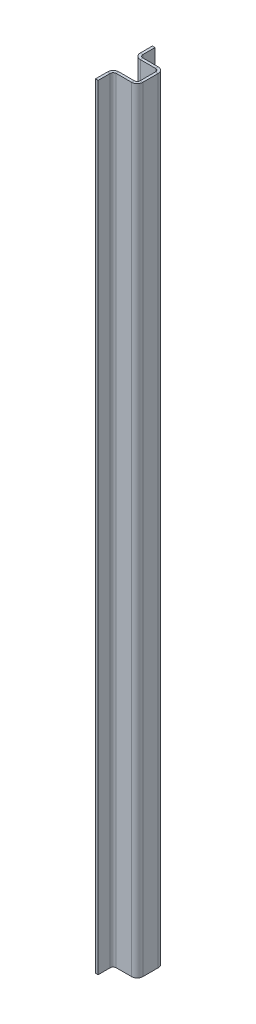
ISO-10303-21;
HEADER;
FILE_DESCRIPTION(('STEP AP214'),'2;1');
FILE_NAME('part.step','',(''),(''),'','','');
FILE_SCHEMA(('AUTOMOTIVE_DESIGN { 1 0 10303 214 1 1 1 1 }'));
ENDSEC;
DATA;
#1=APPLICATION_CONTEXT('core data for automotive mechanical design processes');
#2=APPLICATION_PROTOCOL_DEFINITION('international standard','automotive_design',2000,#1);
#3=PRODUCT_CONTEXT('',#1,'mechanical');
#4=PRODUCT('Part','Part','',(#3));
#5=PRODUCT_RELATED_PRODUCT_CATEGORY('part','',(#4));
#6=PRODUCT_DEFINITION_FORMATION('','',#4);
#7=PRODUCT_DEFINITION_CONTEXT('part definition',#1,'design');
#8=PRODUCT_DEFINITION('design','',#6,#7);
#9=PRODUCT_DEFINITION_SHAPE('','',#8);
#10=(LENGTH_UNIT() NAMED_UNIT(*) SI_UNIT(.MILLI.,.METRE.));
#11=(NAMED_UNIT(*) PLANE_ANGLE_UNIT() SI_UNIT($,.RADIAN.));
#12=(NAMED_UNIT(*) SI_UNIT($,.STERADIAN.) SOLID_ANGLE_UNIT());
#13=UNCERTAINTY_MEASURE_WITH_UNIT(LENGTH_MEASURE(1.E-05),#10,'distance_accuracy_value','');
#14=(GEOMETRIC_REPRESENTATION_CONTEXT(3) GLOBAL_UNCERTAINTY_ASSIGNED_CONTEXT((#13)) GLOBAL_UNIT_ASSIGNED_CONTEXT((#10,
#11,#12)) REPRESENTATION_CONTEXT('',''));
#15=CARTESIAN_POINT('',(0.,0.,0.));
#16=DIRECTION('',(0.,0.,1.));
#17=DIRECTION('',(1.,0.,0.));
#18=AXIS2_PLACEMENT_3D('',#15,#16,#17);
#19=CARTESIAN_POINT('',(-19.05,276.733,9.52500000000009));
#20=DIRECTION('',(0.,-1.,0.));
#21=DIRECTION('',(0.,0.,-1.));
#22=AXIS2_PLACEMENT_3D('',#19,#20,#21);
#23=PLANE('',#22);
#24=DIRECTION('',(0.,1.02846042114419E-13,-1.));
#25=VECTOR('',#24,1.);
#26=CARTESIAN_POINT('',(-14.99362,276.733,9.52500000000004));
#27=LINE('',#26,#25);
#28=CARTESIAN_POINT('',(-14.99362,276.733,9.52500000000004));
#29=VERTEX_POINT('',#28);
#30=CARTESIAN_POINT('',(-14.99362,276.733,7.62762000000008));
#31=VERTEX_POINT('',#30);
#32=EDGE_CURVE('E338',#29,#31,#27,.T.);
#33=ORIENTED_EDGE('',*,*,#32,.F.);
#34=DIRECTION('',(-1.,0.,0.));
#35=VECTOR('',#34,1.);
#36=CARTESIAN_POINT('',(0.,276.733,9.52500000000003));
#37=LINE('',#36,#35);
#38=CARTESIAN_POINT('',(-4.05637999999996,276.733,9.52500000000004));
#39=VERTEX_POINT('',#38);
#40=EDGE_CURVE('E479',#39,#29,#37,.T.);
#41=ORIENTED_EDGE('',*,*,#40,.F.);
#42=DIRECTION('',(0.,0.,-1.));
#43=VECTOR('',#42,1.);
#44=CARTESIAN_POINT('',(-4.05637999999996,276.733,7.62762000000004));
#45=LINE('',#44,#43);
#46=CARTESIAN_POINT('',(-4.05637999999997,276.733,7.62761999999997));
#47=VERTEX_POINT('',#46);
#48=EDGE_CURVE('E494',#47,#39,#45,.F.);
#49=ORIENTED_EDGE('',*,*,#48,.F.);
#50=DIRECTION('',(1.,0.,0.));
#51=VECTOR('',#50,1.);
#52=CARTESIAN_POINT('',(-19.05,276.733,7.6276200000001));
#53=LINE('',#52,#51);
#54=EDGE_CURVE('E486',#47,#31,#53,.F.);
#55=ORIENTED_EDGE('',*,*,#54,.T.);
#56=EDGE_LOOP('',(#33,#41,#49,#55));
#57=FACE_BOUND('',#56,.T.);
#58=ADVANCED_FACE('F124',(#57),#23,.F.);
#59=CARTESIAN_POINT('',(-1.89737999999999,-276.733,9.52499999999997));
#60=DIRECTION('',(0.,1.,0.));
#61=DIRECTION('',(0.,0.,1.));
#62=AXIS2_PLACEMENT_3D('',#59,#60,#61);
#63=PLANE('',#62);
#64=DIRECTION('',(0.,0.,-1.));
#65=VECTOR('',#64,1.);
#66=CARTESIAN_POINT('',(-14.99362,-276.733,9.52500000000004));
#67=LINE('',#66,#65);
#68=CARTESIAN_POINT('',(-14.99362,-276.733,9.52500000000004));
#69=VERTEX_POINT('',#68);
#70=CARTESIAN_POINT('',(-14.99362,-276.733,7.62762000000004));
#71=VERTEX_POINT('',#70);
#72=EDGE_CURVE('E323',#69,#71,#67,.T.);
#73=ORIENTED_EDGE('',*,*,#72,.T.);
#74=DIRECTION('',(-1.,0.,0.));
#75=VECTOR('',#74,1.);
#76=CARTESIAN_POINT('',(-1.89738,-276.733,7.62761999999997));
#77=LINE('',#76,#75);
#78=CARTESIAN_POINT('',(-4.05637999999997,-276.733,7.62761999999997));
#79=VERTEX_POINT('',#78);
#80=EDGE_CURVE('E483',#71,#79,#77,.F.);
#81=ORIENTED_EDGE('',*,*,#80,.T.);
#82=DIRECTION('',(0.,0.,-1.));
#83=VECTOR('',#82,1.);
#84=CARTESIAN_POINT('',(-4.05637999999999,-276.733,9.52499999999997));
#85=LINE('',#84,#83);
#86=CARTESIAN_POINT('',(-4.05637999999996,-276.733,9.52499999999997));
#87=VERTEX_POINT('',#86);
#88=EDGE_CURVE('E471',#79,#87,#85,.F.);
#89=ORIENTED_EDGE('',*,*,#88,.T.);
#90=DIRECTION('',(1.,0.,0.));
#91=VECTOR('',#90,1.);
#92=CARTESIAN_POINT('',(0.,-276.733,9.52499999999996));
#93=LINE('',#92,#91);
#94=EDGE_CURVE('E475',#69,#87,#93,.T.);
#95=ORIENTED_EDGE('',*,*,#94,.F.);
#96=EDGE_LOOP('',(#73,#81,#89,#95));
#97=FACE_BOUND('',#96,.T.);
#98=ADVANCED_FACE('F593',(#97),#63,.F.);
#99=CARTESIAN_POINT('',(0.,0.,9.52499999999999));
#100=DIRECTION('',(0.,0.,-1.));
#101=DIRECTION('',(-1.,0.,0.));
#102=AXIS2_PLACEMENT_3D('',#99,#100,#101);
#103=PLANE('',#102);
#104=DIRECTION('',(0.,-1.,0.));
#105=VECTOR('',#104,1.);
#106=CARTESIAN_POINT('',(-14.99362,-276.733,9.52500000000004));
#107=LINE('',#106,#105);
#108=EDGE_CURVE('E331',#69,#29,#107,.F.);
#109=ORIENTED_EDGE('',*,*,#108,.F.);
#110=ORIENTED_EDGE('',*,*,#94,.T.);
#111=DIRECTION('',(0.,1.,0.));
#112=VECTOR('',#111,1.);
#113=CARTESIAN_POINT('',(-4.05637999999999,-276.733,9.52499999999997));
#114=LINE('',#113,#112);
#115=EDGE_CURVE('E490',#39,#87,#114,.F.);
#116=ORIENTED_EDGE('',*,*,#115,.F.);
#117=ORIENTED_EDGE('',*,*,#40,.T.);
#118=EDGE_LOOP('',(#109,#110,#116,#117));
#119=FACE_BOUND('',#118,.T.);
#120=ADVANCED_FACE('F599',(#119),#103,.F.);
#121=CARTESIAN_POINT('',(0.,0.,7.62761999999999));
#122=DIRECTION('',(0.,0.,-1.));
#123=DIRECTION('',(-1.,0.,0.));
#124=AXIS2_PLACEMENT_3D('',#121,#122,#123);
#125=PLANE('',#124);
#126=ORIENTED_EDGE('',*,*,#80,.F.);
#127=DIRECTION('',(0.,-1.,0.));
#128=VECTOR('',#127,1.);
#129=CARTESIAN_POINT('',(-14.99362,-276.733,7.62762000000004));
#130=LINE('',#129,#128);
#131=EDGE_CURVE('E316',#71,#31,#130,.F.);
#132=ORIENTED_EDGE('',*,*,#131,.T.);
#133=ORIENTED_EDGE('',*,*,#54,.F.);
#134=DIRECTION('',(0.,1.,0.));
#135=VECTOR('',#134,1.);
#136=CARTESIAN_POINT('',(-4.05637999999999,-276.733,7.62761999999997));
#137=LINE('',#136,#135);
#138=EDGE_CURVE('E498',#79,#47,#137,.T.);
#139=ORIENTED_EDGE('',*,*,#138,.F.);
#140=EDGE_LOOP('',(#126,#132,#133,#139));
#141=FACE_BOUND('',#140,.T.);
#142=ADVANCED_FACE('F691',(#141),#125,.T.);
#143=CARTESIAN_POINT('',(-19.05,-276.733,-9.5250000000001));
#144=DIRECTION('',(0.,1.,0.));
#145=DIRECTION('',(0.,0.,1.));
#146=AXIS2_PLACEMENT_3D('',#143,#144,#145);
#147=PLANE('',#146);
#148=DIRECTION('',(0.,0.,1.));
#149=VECTOR('',#148,1.);
#150=CARTESIAN_POINT('',(-14.99362,-276.733,-9.52500000000015));
#151=LINE('',#150,#149);
#152=CARTESIAN_POINT('',(-14.99362,-276.733,-9.52500000000015));
#153=VERTEX_POINT('',#152);
#154=CARTESIAN_POINT('',(-14.99362,-276.733,-7.62762000000008));
#155=VERTEX_POINT('',#154);
#156=EDGE_CURVE('E408',#153,#155,#151,.T.);
#157=ORIENTED_EDGE('',*,*,#156,.F.);
#158=DIRECTION('',(-1.,0.,0.));
#159=VECTOR('',#158,1.);
#160=CARTESIAN_POINT('',(0.,-276.733,-9.52500000000003));
#161=LINE('',#160,#159);
#162=CARTESIAN_POINT('',(-4.05637999999999,-276.733,-9.52500000000004));
#163=VERTEX_POINT('',#162);
#164=EDGE_CURVE('E419',#163,#153,#161,.T.);
#165=ORIENTED_EDGE('',*,*,#164,.F.);
#166=DIRECTION('',(0.,0.,1.));
#167=VECTOR('',#166,1.);
#168=CARTESIAN_POINT('',(-4.05637999999999,-276.733,-7.62762000000004));
#169=LINE('',#168,#167);
#170=CARTESIAN_POINT('',(-4.05637999999998,-276.733,-7.62761999999997));
#171=VERTEX_POINT('',#170);
#172=EDGE_CURVE('E434',#171,#163,#169,.F.);
#173=ORIENTED_EDGE('',*,*,#172,.F.);
#174=DIRECTION('',(1.,0.,0.));
#175=VECTOR('',#174,1.);
#176=CARTESIAN_POINT('',(-19.05,-276.733,-7.6276200000001));
#177=LINE('',#176,#175);
#178=EDGE_CURVE('E426',#171,#155,#177,.F.);
#179=ORIENTED_EDGE('',*,*,#178,.T.);
#180=EDGE_LOOP('',(#157,#165,#173,#179));
#181=FACE_BOUND('',#180,.T.);
#182=ADVANCED_FACE('F573',(#181),#147,.F.);
#183=CARTESIAN_POINT('',(-1.89737999999999,276.733,-9.52499999999997));
#184=DIRECTION('',(0.,-1.,0.));
#185=DIRECTION('',(0.,0.,-1.));
#186=AXIS2_PLACEMENT_3D('',#183,#184,#185);
#187=PLANE('',#186);
#188=DIRECTION('',(0.,0.,1.));
#189=VECTOR('',#188,1.);
#190=CARTESIAN_POINT('',(-14.99362,276.733,-9.52499999999993));
#191=LINE('',#190,#189);
#192=CARTESIAN_POINT('',(-14.99362,276.733,-9.52499999999993));
#193=VERTEX_POINT('',#192);
#194=CARTESIAN_POINT('',(-14.99362,276.733,-7.62761999999993));
#195=VERTEX_POINT('',#194);
#196=EDGE_CURVE('E394',#193,#195,#191,.T.);
#197=ORIENTED_EDGE('',*,*,#196,.T.);
#198=DIRECTION('',(-1.,0.,0.));
#199=VECTOR('',#198,1.);
#200=CARTESIAN_POINT('',(-1.89738,276.733,-7.62761999999997));
#201=LINE('',#200,#199);
#202=CARTESIAN_POINT('',(-4.05637999999998,276.733,-7.62761999999997));
#203=VERTEX_POINT('',#202);
#204=EDGE_CURVE('E423',#195,#203,#201,.F.);
#205=ORIENTED_EDGE('',*,*,#204,.T.);
#206=DIRECTION('',(0.,0.,1.));
#207=VECTOR('',#206,1.);
#208=CARTESIAN_POINT('',(-4.05637999999999,276.733,-9.52499999999997));
#209=LINE('',#208,#207);
#210=CARTESIAN_POINT('',(-4.05637999999998,276.733,-9.52499999999997));
#211=VERTEX_POINT('',#210);
#212=EDGE_CURVE('E411',#203,#211,#209,.F.);
#213=ORIENTED_EDGE('',*,*,#212,.T.);
#214=DIRECTION('',(1.,0.,0.));
#215=VECTOR('',#214,1.);
#216=CARTESIAN_POINT('',(0.,276.733,-9.52499999999996));
#217=LINE('',#216,#215);
#218=EDGE_CURVE('E415',#193,#211,#217,.T.);
#219=ORIENTED_EDGE('',*,*,#218,.F.);
#220=EDGE_LOOP('',(#197,#205,#213,#219));
#221=FACE_BOUND('',#220,.T.);
#222=ADVANCED_FACE('F709',(#221),#187,.F.);
#223=CARTESIAN_POINT('',(0.,0.,-9.525));
#224=DIRECTION('',(0.,0.,1.));
#225=DIRECTION('',(1.,0.,0.));
#226=AXIS2_PLACEMENT_3D('',#223,#224,#225);
#227=PLANE('',#226);
#228=DIRECTION('',(0.,1.,0.));
#229=VECTOR('',#228,1.);
#230=CARTESIAN_POINT('',(-14.99362,276.733,-9.52499999999993));
#231=LINE('',#230,#229);
#232=EDGE_CURVE('E402',#193,#153,#231,.F.);
#233=ORIENTED_EDGE('',*,*,#232,.F.);
#234=ORIENTED_EDGE('',*,*,#218,.T.);
#235=DIRECTION('',(0.,-1.,0.));
#236=VECTOR('',#235,1.);
#237=CARTESIAN_POINT('',(-4.05637999999999,276.733,-9.52499999999997));
#238=LINE('',#237,#236);
#239=EDGE_CURVE('E430',#163,#211,#238,.F.);
#240=ORIENTED_EDGE('',*,*,#239,.F.);
#241=ORIENTED_EDGE('',*,*,#164,.T.);
#242=EDGE_LOOP('',(#233,#234,#240,#241));
#243=FACE_BOUND('',#242,.T.);
#244=ADVANCED_FACE('F578',(#243),#227,.F.);
#245=CARTESIAN_POINT('',(0.,0.,-7.62762));
#246=DIRECTION('',(0.,0.,1.));
#247=DIRECTION('',(1.,0.,0.));
#248=AXIS2_PLACEMENT_3D('',#245,#246,#247);
#249=PLANE('',#248);
#250=ORIENTED_EDGE('',*,*,#204,.F.);
#251=DIRECTION('',(0.,1.,0.));
#252=VECTOR('',#251,1.);
#253=CARTESIAN_POINT('',(-14.99362,276.733,-7.62761999999993));
#254=LINE('',#253,#252);
#255=EDGE_CURVE('E387',#195,#155,#254,.F.);
#256=ORIENTED_EDGE('',*,*,#255,.T.);
#257=ORIENTED_EDGE('',*,*,#178,.F.);
#258=DIRECTION('',(0.,-1.,0.));
#259=VECTOR('',#258,1.);
#260=CARTESIAN_POINT('',(-4.05637999999999,276.733,-7.62761999999997));
#261=LINE('',#260,#259);
#262=EDGE_CURVE('E438',#203,#171,#261,.T.);
#263=ORIENTED_EDGE('',*,*,#262,.F.);
#264=EDGE_LOOP('',(#250,#256,#257,#263));
#265=FACE_BOUND('',#264,.T.);
#266=ADVANCED_FACE('F570',(#265),#249,.T.);
#267=CARTESIAN_POINT('',(-1.89738,0.,0.));
#268=DIRECTION('',(1.,0.,0.));
#269=DIRECTION('',(0.,0.,-1.));
#270=AXIS2_PLACEMENT_3D('',#267,#268,#269);
#271=PLANE('',#270);
#272=DIRECTION('',(0.,-1.,0.));
#273=VECTOR('',#272,1.);
#274=CARTESIAN_POINT('',(-1.89738000000003,-276.733,-5.46862000000004));
#275=LINE('',#274,#273);
#276=CARTESIAN_POINT('',(-1.89738000000003,-276.733,-5.46862000000004));
#277=VERTEX_POINT('',#276);
#278=CARTESIAN_POINT('',(-1.89738000000003,276.733,-5.46862000000004));
#279=VERTEX_POINT('',#278);
#280=EDGE_CURVE('E461',#277,#279,#275,.F.);
#281=ORIENTED_EDGE('',*,*,#280,.F.);
#282=DIRECTION('',(0.,0.,-1.));
#283=VECTOR('',#282,1.);
#284=CARTESIAN_POINT('',(-1.89738,-276.733,9.52499999999997));
#285=LINE('',#284,#283);
#286=CARTESIAN_POINT('',(-1.89738000000001,-276.733,5.46862000000004));
#287=VERTEX_POINT('',#286);
#288=EDGE_CURVE('E13',#287,#277,#285,.T.);
#289=ORIENTED_EDGE('',*,*,#288,.F.);
#290=DIRECTION('',(0.,1.,0.));
#291=VECTOR('',#290,1.);
#292=CARTESIAN_POINT('',(-1.89738000000001,276.733,5.46862000000004));
#293=LINE('',#292,#291);
#294=CARTESIAN_POINT('',(-1.89738000000001,276.733,5.46862000000004));
#295=VERTEX_POINT('',#294);
#296=EDGE_CURVE('E521',#295,#287,#293,.F.);
#297=ORIENTED_EDGE('',*,*,#296,.F.);
#298=DIRECTION('',(0.,0.,1.));
#299=VECTOR('',#298,1.);
#300=CARTESIAN_POINT('',(-1.89738,276.733,9.52500000000003));
#301=LINE('',#300,#299);
#302=EDGE_CURVE('E134',#279,#295,#301,.T.);
#303=ORIENTED_EDGE('',*,*,#302,.F.);
#304=EDGE_LOOP('',(#281,#289,#297,#303));
#305=FACE_BOUND('',#304,.T.);
#306=ADVANCED_FACE('F560',(#305),#271,.F.);
#307=CARTESIAN_POINT('',(0.,0.,0.));
#308=DIRECTION('',(1.,0.,0.));
#309=DIRECTION('',(0.,0.,-1.));
#310=AXIS2_PLACEMENT_3D('',#307,#308,#309);
#311=PLANE('',#310);
#312=DIRECTION('',(0.,0.,-1.));
#313=VECTOR('',#312,1.);
#314=CARTESIAN_POINT('',(0.,-276.733,9.52499999999997));
#315=LINE('',#314,#313);
#316=CARTESIAN_POINT('',(0.,-276.733,5.46862000000004));
#317=VERTEX_POINT('',#316);
#318=CARTESIAN_POINT('',(0.,-276.733,-5.46862000000007));
#319=VERTEX_POINT('',#318);
#320=EDGE_CURVE('E128',#317,#319,#315,.T.);
#321=ORIENTED_EDGE('',*,*,#320,.T.);
#322=DIRECTION('',(0.,-1.,0.));
#323=VECTOR('',#322,1.);
#324=CARTESIAN_POINT('',(0.,-276.733,-5.46862000000007));
#325=LINE('',#324,#323);
#326=CARTESIAN_POINT('',(0.,276.733,-5.46862000000004));
#327=VERTEX_POINT('',#326);
#328=EDGE_CURVE('E444',#319,#327,#325,.F.);
#329=ORIENTED_EDGE('',*,*,#328,.T.);
#330=DIRECTION('',(0.,0.,1.));
#331=VECTOR('',#330,1.);
#332=CARTESIAN_POINT('',(0.,276.733,9.52500000000003));
#333=LINE('',#332,#331);
#334=CARTESIAN_POINT('',(0.,276.733,5.46862000000007));
#335=VERTEX_POINT('',#334);
#336=EDGE_CURVE('E531',#327,#335,#333,.T.);
#337=ORIENTED_EDGE('',*,*,#336,.T.);
#338=DIRECTION('',(0.,1.,0.));
#339=VECTOR('',#338,1.);
#340=CARTESIAN_POINT('',(0.,276.733,5.46862000000007));
#341=LINE('',#340,#339);
#342=EDGE_CURVE('E504',#335,#317,#341,.F.);
#343=ORIENTED_EDGE('',*,*,#342,.T.);
#344=EDGE_LOOP('',(#321,#329,#337,#343));
#345=FACE_BOUND('',#344,.T.);
#346=ADVANCED_FACE('F544',(#345),#311,.T.);
#347=CARTESIAN_POINT('',(-1.89738,-276.733,9.52499999999997));
#348=DIRECTION('',(0.,-1.,0.));
#349=DIRECTION('',(0.,0.,-1.));
#350=AXIS2_PLACEMENT_3D('',#347,#348,#349);
#351=PLANE('',#350);
#352=ORIENTED_EDGE('',*,*,#288,.T.);
#353=DIRECTION('',(1.,0.,0.));
#354=VECTOR('',#353,1.);
#355=CARTESIAN_POINT('',(-1.89738000000003,-276.733,-5.46862000000004));
#356=LINE('',#355,#354);
#357=EDGE_CURVE('E453',#277,#319,#356,.T.);
#358=ORIENTED_EDGE('',*,*,#357,.T.);
#359=ORIENTED_EDGE('',*,*,#320,.F.);
#360=DIRECTION('',(1.,0.,0.));
#361=VECTOR('',#360,1.);
#362=CARTESIAN_POINT('',(-1.89738000000001,-276.733,5.46862000000004));
#363=LINE('',#362,#361);
#364=EDGE_CURVE('E527',#287,#317,#363,.T.);
#365=ORIENTED_EDGE('',*,*,#364,.F.);
#366=EDGE_LOOP('',(#352,#358,#359,#365));
#367=FACE_BOUND('',#366,.T.);
#368=ADVANCED_FACE('F547',(#367),#351,.T.);
#369=CARTESIAN_POINT('',(-1.89738,276.733,9.52500000000003));
#370=DIRECTION('',(0.,1.,0.));
#371=DIRECTION('',(0.,0.,1.));
#372=AXIS2_PLACEMENT_3D('',#369,#370,#371);
#373=PLANE('',#372);
#374=DIRECTION('',(1.,0.,0.));
#375=VECTOR('',#374,1.);
#376=CARTESIAN_POINT('',(-1.89738000000003,276.733,-5.46862000000004));
#377=LINE('',#376,#375);
#378=EDGE_CURVE('E467',#279,#327,#377,.T.);
#379=ORIENTED_EDGE('',*,*,#378,.F.);
#380=ORIENTED_EDGE('',*,*,#302,.T.);
#381=DIRECTION('',(1.,0.,0.));
#382=VECTOR('',#381,1.);
#383=CARTESIAN_POINT('',(-1.89738000000001,276.733,5.46862000000004));
#384=LINE('',#383,#382);
#385=EDGE_CURVE('E513',#295,#335,#384,.T.);
#386=ORIENTED_EDGE('',*,*,#385,.T.);
#387=ORIENTED_EDGE('',*,*,#336,.F.);
#388=EDGE_LOOP('',(#379,#380,#386,#387));
#389=FACE_BOUND('',#388,.T.);
#390=ADVANCED_FACE('F126',(#389),#373,.T.);
#391=CARTESIAN_POINT('',(-4.05637999999998,-276.733,5.46862000000001));
#392=DIRECTION('',(0.,-1.,0.));
#393=DIRECTION('',(0.,0.,-1.));
#394=AXIS2_PLACEMENT_3D('',#391,#392,#393);
#395=PLANE('',#394);
#396=ORIENTED_EDGE('',*,*,#88,.F.);
#397=CARTESIAN_POINT('',(-4.05637999999998,-276.733,5.46862000000001));
#398=DIRECTION('',(0.,1.,0.));
#399=DIRECTION('',(0.,0.,1.));
#400=AXIS2_PLACEMENT_3D('',#397,#398,#399);
#401=CIRCLE('',#400,2.15899999999996);
#402=EDGE_CURVE('E517',#287,#79,#401,.F.);
#403=ORIENTED_EDGE('',*,*,#402,.F.);
#404=ORIENTED_EDGE('',*,*,#364,.T.);
#405=CARTESIAN_POINT('',(-4.05637999999998,-276.733,5.46862000000001));
#406=DIRECTION('',(0.,1.,0.));
#407=DIRECTION('',(0.,0.,1.));
#408=AXIS2_PLACEMENT_3D('',#405,#406,#407);
#409=CIRCLE('',#408,4.05637999999996);
#410=EDGE_CURVE('E508',#317,#87,#409,.F.);
#411=ORIENTED_EDGE('',*,*,#410,.T.);
#412=EDGE_LOOP('',(#396,#403,#404,#411));
#413=FACE_BOUND('',#412,.T.);
#414=ADVANCED_FACE('F614',(#413),#395,.T.);
#415=CARTESIAN_POINT('',(-4.05637999999998,276.733,5.46862000000001));
#416=DIRECTION('',(0.,-1.,0.));
#417=DIRECTION('',(0.,0.,-1.));
#418=AXIS2_PLACEMENT_3D('',#415,#416,#417);
#419=PLANE('',#418);
#420=CARTESIAN_POINT('',(-4.05637999999998,276.733,5.46862000000001));
#421=DIRECTION('',(0.,1.,0.));
#422=DIRECTION('',(0.,0.,1.));
#423=AXIS2_PLACEMENT_3D('',#420,#421,#422);
#424=CIRCLE('',#423,2.15899999999996);
#425=EDGE_CURVE('E478',#47,#295,#424,.T.);
#426=ORIENTED_EDGE('',*,*,#425,.F.);
#427=ORIENTED_EDGE('',*,*,#48,.T.);
#428=CARTESIAN_POINT('',(-4.05637999999998,276.733,5.46862000000001));
#429=DIRECTION('',(0.,1.,0.));
#430=DIRECTION('',(0.,0.,1.));
#431=AXIS2_PLACEMENT_3D('',#428,#429,#430);
#432=CIRCLE('',#431,4.05637999999996);
#433=EDGE_CURVE('E509',#39,#335,#432,.T.);
#434=ORIENTED_EDGE('',*,*,#433,.T.);
#435=ORIENTED_EDGE('',*,*,#385,.F.);
#436=EDGE_LOOP('',(#426,#427,#434,#435));
#437=FACE_BOUND('',#436,.T.);
#438=ADVANCED_FACE('F609',(#437),#419,.F.);
#439=CARTESIAN_POINT('',(-4.05637999999998,276.733,5.46862000000001));
#440=DIRECTION('',(0.,1.,0.));
#441=DIRECTION('',(0.,0.,1.));
#442=AXIS2_PLACEMENT_3D('',#439,#440,#441);
#443=CYLINDRICAL_SURFACE('',#442,4.05637999999996);
#444=ORIENTED_EDGE('',*,*,#342,.F.);
#445=ORIENTED_EDGE('',*,*,#433,.F.);
#446=ORIENTED_EDGE('',*,*,#115,.T.);
#447=ORIENTED_EDGE('',*,*,#410,.F.);
#448=EDGE_LOOP('',(#444,#445,#446,#447));
#449=FACE_BOUND('',#448,.T.);
#450=ADVANCED_FACE('F605',(#449),#443,.T.);
#451=CARTESIAN_POINT('',(-4.05637999999998,276.733,5.46862000000001));
#452=DIRECTION('',(0.,1.,0.));
#453=DIRECTION('',(0.,0.,1.));
#454=AXIS2_PLACEMENT_3D('',#451,#452,#453);
#455=CYLINDRICAL_SURFACE('',#454,2.15899999999996);
#456=ORIENTED_EDGE('',*,*,#296,.T.);
#457=ORIENTED_EDGE('',*,*,#402,.T.);
#458=ORIENTED_EDGE('',*,*,#138,.T.);
#459=ORIENTED_EDGE('',*,*,#425,.T.);
#460=EDGE_LOOP('',(#456,#457,#458,#459));
#461=FACE_BOUND('',#460,.T.);
#462=ADVANCED_FACE('F608',(#461),#455,.F.);
#463=CARTESIAN_POINT('',(-4.05637999999999,276.733,-5.46862000000001));
#464=DIRECTION('',(0.,1.,0.));
#465=DIRECTION('',(0.,0.,1.));
#466=AXIS2_PLACEMENT_3D('',#463,#464,#465);
#467=PLANE('',#466);
#468=ORIENTED_EDGE('',*,*,#212,.F.);
#469=CARTESIAN_POINT('',(-4.05637999999999,276.733,-5.46862000000001));
#470=DIRECTION('',(0.,-1.,0.));
#471=DIRECTION('',(0.,0.,-1.));
#472=AXIS2_PLACEMENT_3D('',#469,#470,#471);
#473=CIRCLE('',#472,2.15899999999996);
#474=EDGE_CURVE('E457',#279,#203,#473,.F.);
#475=ORIENTED_EDGE('',*,*,#474,.F.);
#476=ORIENTED_EDGE('',*,*,#378,.T.);
#477=CARTESIAN_POINT('',(-4.05637999999999,276.733,-5.46862000000001));
#478=DIRECTION('',(0.,-1.,0.));
#479=DIRECTION('',(0.,0.,-1.));
#480=AXIS2_PLACEMENT_3D('',#477,#478,#479);
#481=CIRCLE('',#480,4.05637999999996);
#482=EDGE_CURVE('E448',#327,#211,#481,.F.);
#483=ORIENTED_EDGE('',*,*,#482,.T.);
#484=EDGE_LOOP('',(#468,#475,#476,#483));
#485=FACE_BOUND('',#484,.T.);
#486=ADVANCED_FACE('F566',(#485),#467,.T.);
#487=CARTESIAN_POINT('',(-4.05637999999999,-276.733,-5.46862000000001));
#488=DIRECTION('',(0.,1.,0.));
#489=DIRECTION('',(0.,0.,1.));
#490=AXIS2_PLACEMENT_3D('',#487,#488,#489);
#491=PLANE('',#490);
#492=CARTESIAN_POINT('',(-4.05637999999999,-276.733,-5.46862000000001));
#493=DIRECTION('',(0.,-1.,0.));
#494=DIRECTION('',(0.,0.,-1.));
#495=AXIS2_PLACEMENT_3D('',#492,#493,#494);
#496=CIRCLE('',#495,2.15899999999996);
#497=EDGE_CURVE('E418',#171,#277,#496,.T.);
#498=ORIENTED_EDGE('',*,*,#497,.F.);
#499=ORIENTED_EDGE('',*,*,#172,.T.);
#500=CARTESIAN_POINT('',(-4.05637999999999,-276.733,-5.46862000000001));
#501=DIRECTION('',(0.,-1.,0.));
#502=DIRECTION('',(0.,0.,-1.));
#503=AXIS2_PLACEMENT_3D('',#500,#501,#502);
#504=CIRCLE('',#503,4.05637999999996);
#505=EDGE_CURVE('E449',#163,#319,#504,.T.);
#506=ORIENTED_EDGE('',*,*,#505,.T.);
#507=ORIENTED_EDGE('',*,*,#357,.F.);
#508=EDGE_LOOP('',(#498,#499,#506,#507));
#509=FACE_BOUND('',#508,.T.);
#510=ADVANCED_FACE('F551',(#509),#491,.F.);
#511=CARTESIAN_POINT('',(-4.05637999999999,-276.733,-5.46862000000001));
#512=DIRECTION('',(0.,-1.,0.));
#513=DIRECTION('',(0.,0.,-1.));
#514=AXIS2_PLACEMENT_3D('',#511,#512,#513);
#515=CYLINDRICAL_SURFACE('',#514,4.05637999999996);
#516=ORIENTED_EDGE('',*,*,#328,.F.);
#517=ORIENTED_EDGE('',*,*,#505,.F.);
#518=ORIENTED_EDGE('',*,*,#239,.T.);
#519=ORIENTED_EDGE('',*,*,#482,.F.);
#520=EDGE_LOOP('',(#516,#517,#518,#519));
#521=FACE_BOUND('',#520,.T.);
#522=ADVANCED_FACE('F581',(#521),#515,.T.);
#523=CARTESIAN_POINT('',(-4.05637999999999,-276.733,-5.46862000000001));
#524=DIRECTION('',(0.,-1.,0.));
#525=DIRECTION('',(0.,0.,-1.));
#526=AXIS2_PLACEMENT_3D('',#523,#524,#525);
#527=CYLINDRICAL_SURFACE('',#526,2.15899999999996);
#528=ORIENTED_EDGE('',*,*,#280,.T.);
#529=ORIENTED_EDGE('',*,*,#474,.T.);
#530=ORIENTED_EDGE('',*,*,#262,.T.);
#531=ORIENTED_EDGE('',*,*,#497,.T.);
#532=EDGE_LOOP('',(#528,#529,#530,#531));
#533=FACE_BOUND('',#532,.T.);
#534=ADVANCED_FACE('F555',(#533),#527,.F.);
#535=CARTESIAN_POINT('',(-14.99362,-276.733,-11.6840000000002));
#536=DIRECTION('',(0.,-1.,0.));
#537=DIRECTION('',(0.,0.,-1.));
#538=AXIS2_PLACEMENT_3D('',#535,#536,#537);
#539=PLANE('',#538);
#540=DIRECTION('',(1.,0.,0.));
#541=VECTOR('',#540,1.);
#542=CARTESIAN_POINT('',(-19.05,-276.733,-11.6840000000001));
#543=LINE('',#542,#541);
#544=CARTESIAN_POINT('',(-17.15262,-276.733,-11.6840000000002));
#545=VERTEX_POINT('',#544);
#546=CARTESIAN_POINT('',(-19.05,-276.733,-11.6840000000001));
#547=VERTEX_POINT('',#546);
#548=EDGE_CURVE('E341',#545,#547,#543,.F.);
#549=ORIENTED_EDGE('',*,*,#548,.F.);
#550=CARTESIAN_POINT('',(-14.99362,-276.733,-11.6840000000002));
#551=DIRECTION('',(0.,1.,0.));
#552=DIRECTION('',(0.,0.,1.));
#553=AXIS2_PLACEMENT_3D('',#550,#551,#552);
#554=CIRCLE('',#553,2.159);
#555=EDGE_CURVE('E398',#153,#545,#554,.F.);
#556=ORIENTED_EDGE('',*,*,#555,.F.);
#557=ORIENTED_EDGE('',*,*,#156,.T.);
#558=CARTESIAN_POINT('',(-14.99362,-276.733,-11.6840000000002));
#559=DIRECTION('',(0.,1.,0.));
#560=DIRECTION('',(0.,0.,1.));
#561=AXIS2_PLACEMENT_3D('',#558,#559,#560);
#562=CIRCLE('',#561,4.05638);
#563=EDGE_CURVE('E150',#155,#547,#562,.F.);
#564=ORIENTED_EDGE('',*,*,#563,.T.);
#565=EDGE_LOOP('',(#549,#556,#557,#564));
#566=FACE_BOUND('',#565,.T.);
#567=ADVANCED_FACE('F588',(#566),#539,.T.);
#568=CARTESIAN_POINT('',(-14.99362,276.733,-11.6839999999999));
#569=DIRECTION('',(0.,-1.,0.));
#570=DIRECTION('',(0.,0.,-1.));
#571=AXIS2_PLACEMENT_3D('',#568,#569,#570);
#572=PLANE('',#571);
#573=CARTESIAN_POINT('',(-14.99362,276.733,-11.6839999999999));
#574=DIRECTION('',(0.,1.,0.));
#575=DIRECTION('',(0.,0.,1.));
#576=AXIS2_PLACEMENT_3D('',#573,#574,#575);
#577=CIRCLE('',#576,2.159);
#578=CARTESIAN_POINT('',(-17.15262,276.733,-11.6839999999999));
#579=VERTEX_POINT('',#578);
#580=EDGE_CURVE('E349',#579,#193,#577,.T.);
#581=ORIENTED_EDGE('',*,*,#580,.F.);
#582=DIRECTION('',(1.,0.,0.));
#583=VECTOR('',#582,1.);
#584=CARTESIAN_POINT('',(-17.15262,276.733,-11.684));
#585=LINE('',#584,#583);
#586=CARTESIAN_POINT('',(-19.05,276.733,-11.684));
#587=VERTEX_POINT('',#586);
#588=EDGE_CURVE('E377',#579,#587,#585,.F.);
#589=ORIENTED_EDGE('',*,*,#588,.T.);
#590=CARTESIAN_POINT('',(-14.99362,276.733,-11.6839999999999));
#591=DIRECTION('',(0.,1.,0.));
#592=DIRECTION('',(0.,0.,1.));
#593=AXIS2_PLACEMENT_3D('',#590,#591,#592);
#594=CIRCLE('',#593,4.05638);
#595=EDGE_CURVE('E391',#587,#195,#594,.T.);
#596=ORIENTED_EDGE('',*,*,#595,.T.);
#597=ORIENTED_EDGE('',*,*,#196,.F.);
#598=EDGE_LOOP('',(#581,#589,#596,#597));
#599=FACE_BOUND('',#598,.T.);
#600=ADVANCED_FACE('F740',(#599),#572,.F.);
#601=CARTESIAN_POINT('',(-14.99362,276.733,-11.6839999999999));
#602=DIRECTION('',(0.,1.,0.));
#603=DIRECTION('',(-1.,0.,0.));
#604=AXIS2_PLACEMENT_3D('',#601,#602,#603);
#605=CYLINDRICAL_SURFACE('',#604,4.05638);
#606=ORIENTED_EDGE('',*,*,#255,.F.);
#607=ORIENTED_EDGE('',*,*,#595,.F.);
#608=DIRECTION('',(0.,1.,0.));
#609=VECTOR('',#608,1.);
#610=CARTESIAN_POINT('',(-19.05,-276.733,-11.6840000000001));
#611=LINE('',#610,#609);
#612=EDGE_CURVE('E374',#587,#547,#611,.F.);
#613=ORIENTED_EDGE('',*,*,#612,.T.);
#614=ORIENTED_EDGE('',*,*,#563,.F.);
#615=EDGE_LOOP('',(#606,#607,#613,#614));
#616=FACE_BOUND('',#615,.T.);
#617=ADVANCED_FACE('F750',(#616),#605,.T.);
#618=CARTESIAN_POINT('',(-14.99362,276.733,-11.6839999999999));
#619=DIRECTION('',(0.,1.,0.));
#620=DIRECTION('',(-1.,0.,0.));
#621=AXIS2_PLACEMENT_3D('',#618,#619,#620);
#622=CYLINDRICAL_SURFACE('',#621,2.159);
#623=ORIENTED_EDGE('',*,*,#232,.T.);
#624=ORIENTED_EDGE('',*,*,#555,.T.);
#625=DIRECTION('',(0.,1.,0.));
#626=VECTOR('',#625,1.);
#627=CARTESIAN_POINT('',(-17.15262,-276.733,-11.6840000000001));
#628=LINE('',#627,#626);
#629=EDGE_CURVE('E381',#545,#579,#628,.T.);
#630=ORIENTED_EDGE('',*,*,#629,.T.);
#631=ORIENTED_EDGE('',*,*,#580,.T.);
#632=EDGE_LOOP('',(#623,#624,#630,#631));
#633=FACE_BOUND('',#632,.T.);
#634=ADVANCED_FACE('F761',(#633),#622,.F.);
#635=CARTESIAN_POINT('',(-19.05,276.733,-20.32762));
#636=DIRECTION('',(0.,-1.,0.));
#637=DIRECTION('',(1.,0.,0.));
#638=AXIS2_PLACEMENT_3D('',#635,#636,#637);
#639=PLANE('',#638);
#640=ORIENTED_EDGE('',*,*,#588,.F.);
#641=DIRECTION('',(0.,0.,1.));
#642=VECTOR('',#641,1.);
#643=CARTESIAN_POINT('',(-17.15262,276.733,-20.32762));
#644=LINE('',#643,#642);
#645=CARTESIAN_POINT('',(-17.15262,276.733,-20.32762));
#646=VERTEX_POINT('',#645);
#647=EDGE_CURVE('E371',#579,#646,#644,.F.);
#648=ORIENTED_EDGE('',*,*,#647,.T.);
#649=DIRECTION('',(1.,0.,0.));
#650=VECTOR('',#649,1.);
#651=CARTESIAN_POINT('',(-19.05,276.733,-20.32762));
#652=LINE('',#651,#650);
#653=CARTESIAN_POINT('',(-19.05,276.733,-20.32762));
#654=VERTEX_POINT('',#653);
#655=EDGE_CURVE('E345',#654,#646,#652,.T.);
#656=ORIENTED_EDGE('',*,*,#655,.F.);
#657=DIRECTION('',(0.,0.,-1.));
#658=VECTOR('',#657,1.);
#659=CARTESIAN_POINT('',(-19.05,276.733,0.));
#660=LINE('',#659,#658);
#661=EDGE_CURVE('E361',#587,#654,#660,.T.);
#662=ORIENTED_EDGE('',*,*,#661,.F.);
#663=EDGE_LOOP('',(#640,#648,#656,#662));
#664=FACE_BOUND('',#663,.T.);
#665=ADVANCED_FACE('F771',(#664),#639,.F.);
#666=CARTESIAN_POINT('',(-19.05,-276.733,-9.52500000000009));
#667=DIRECTION('',(0.,1.,0.));
#668=DIRECTION('',(-1.,0.,0.));
#669=AXIS2_PLACEMENT_3D('',#666,#667,#668);
#670=PLANE('',#669);
#671=ORIENTED_EDGE('',*,*,#548,.T.);
#672=DIRECTION('',(0.,0.,1.));
#673=VECTOR('',#672,1.);
#674=CARTESIAN_POINT('',(-19.05,-276.733,0.));
#675=LINE('',#674,#673);
#676=CARTESIAN_POINT('',(-19.05,-276.733,-20.3276200000001));
#677=VERTEX_POINT('',#676);
#678=EDGE_CURVE('E354',#677,#547,#675,.T.);
#679=ORIENTED_EDGE('',*,*,#678,.F.);
#680=DIRECTION('',(1.,0.,0.));
#681=VECTOR('',#680,1.);
#682=CARTESIAN_POINT('',(-19.05,-276.733,-20.3276200000001));
#683=LINE('',#682,#681);
#684=CARTESIAN_POINT('',(-17.15262,-276.733,-20.3276200000001));
#685=VERTEX_POINT('',#684);
#686=EDGE_CURVE('E350',#677,#685,#683,.T.);
#687=ORIENTED_EDGE('',*,*,#686,.T.);
#688=DIRECTION('',(0.,0.,-1.));
#689=VECTOR('',#688,1.);
#690=CARTESIAN_POINT('',(-17.15262,-276.733,-9.52500000000009));
#691=LINE('',#690,#689);
#692=EDGE_CURVE('E364',#685,#545,#691,.F.);
#693=ORIENTED_EDGE('',*,*,#692,.T.);
#694=EDGE_LOOP('',(#671,#679,#687,#693));
#695=FACE_BOUND('',#694,.T.);
#696=ADVANCED_FACE('F782',(#695),#670,.F.);
#697=CARTESIAN_POINT('',(-19.05,0.,0.));
#698=DIRECTION('',(1.,0.,0.));
#699=DIRECTION('',(0.,0.,-1.));
#700=AXIS2_PLACEMENT_3D('',#697,#698,#699);
#701=PLANE('',#700);
#702=ORIENTED_EDGE('',*,*,#612,.F.);
#703=ORIENTED_EDGE('',*,*,#661,.T.);
#704=DIRECTION('',(0.,-1.,0.));
#705=VECTOR('',#704,1.);
#706=CARTESIAN_POINT('',(-19.05,0.,-20.3276200000001));
#707=LINE('',#706,#705);
#708=EDGE_CURVE('E358',#654,#677,#707,.T.);
#709=ORIENTED_EDGE('',*,*,#708,.T.);
#710=ORIENTED_EDGE('',*,*,#678,.T.);
#711=EDGE_LOOP('',(#702,#703,#709,#710));
#712=FACE_BOUND('',#711,.T.);
#713=ADVANCED_FACE('F793',(#712),#701,.F.);
#714=CARTESIAN_POINT('',(-17.15262,0.,0.));
#715=DIRECTION('',(1.,0.,0.));
#716=DIRECTION('',(0.,0.,-1.));
#717=AXIS2_PLACEMENT_3D('',#714,#715,#716);
#718=PLANE('',#717);
#719=ORIENTED_EDGE('',*,*,#647,.F.);
#720=ORIENTED_EDGE('',*,*,#629,.F.);
#721=ORIENTED_EDGE('',*,*,#692,.F.);
#722=DIRECTION('',(0.,1.,0.));
#723=VECTOR('',#722,1.);
#724=CARTESIAN_POINT('',(-17.15262,-276.733,-20.3276200000001));
#725=LINE('',#724,#723);
#726=EDGE_CURVE('E368',#646,#685,#725,.F.);
#727=ORIENTED_EDGE('',*,*,#726,.F.);
#728=EDGE_LOOP('',(#719,#720,#721,#727));
#729=FACE_BOUND('',#728,.T.);
#730=ADVANCED_FACE('F804',(#729),#718,.T.);
#731=CARTESIAN_POINT('',(-19.05,-276.733,-20.3276200000001));
#732=DIRECTION('',(0.,0.,1.));
#733=DIRECTION('',(0.,-1.,0.));
#734=AXIS2_PLACEMENT_3D('',#731,#732,#733);
#735=PLANE('',#734);
#736=ORIENTED_EDGE('',*,*,#726,.T.);
#737=ORIENTED_EDGE('',*,*,#686,.F.);
#738=ORIENTED_EDGE('',*,*,#708,.F.);
#739=ORIENTED_EDGE('',*,*,#655,.T.);
#740=EDGE_LOOP('',(#736,#737,#738,#739));
#741=FACE_BOUND('',#740,.T.);
#742=ADVANCED_FACE('F815',(#741),#735,.F.);
#743=CARTESIAN_POINT('',(-14.99362,276.733,11.684));
#744=DIRECTION('',(0.,1.,0.));
#745=DIRECTION('',(0.,0.,1.));
#746=AXIS2_PLACEMENT_3D('',#743,#744,#745);
#747=PLANE('',#746);
#748=DIRECTION('',(1.,0.,0.));
#749=VECTOR('',#748,1.);
#750=CARTESIAN_POINT('',(-19.05,276.733,11.6840000000001));
#751=LINE('',#750,#749);
#752=CARTESIAN_POINT('',(-17.15262,276.733,11.684));
#753=VERTEX_POINT('',#752);
#754=CARTESIAN_POINT('',(-19.05,276.732999999999,11.684));
#755=VERTEX_POINT('',#754);
#756=EDGE_CURVE('E290',#753,#755,#751,.F.);
#757=ORIENTED_EDGE('',*,*,#756,.F.);
#758=CARTESIAN_POINT('',(-14.99362,276.733,11.684));
#759=DIRECTION('',(0.,-1.,0.));
#760=DIRECTION('',(0.,0.,-1.));
#761=AXIS2_PLACEMENT_3D('',#758,#759,#760);
#762=CIRCLE('',#761,2.159);
#763=EDGE_CURVE('E327',#29,#753,#762,.F.);
#764=ORIENTED_EDGE('',*,*,#763,.F.);
#765=ORIENTED_EDGE('',*,*,#32,.T.);
#766=CARTESIAN_POINT('',(-14.99362,276.732999999999,11.684));
#767=DIRECTION('',(0.,-1.,0.));
#768=DIRECTION('',(0.,0.,-1.));
#769=AXIS2_PLACEMENT_3D('',#766,#767,#768);
#770=CIRCLE('',#769,4.05638);
#771=EDGE_CURVE('E142',#31,#755,#770,.F.);
#772=ORIENTED_EDGE('',*,*,#771,.T.);
#773=EDGE_LOOP('',(#757,#764,#765,#772));
#774=FACE_BOUND('',#773,.T.);
#775=ADVANCED_FACE('F826',(#774),#747,.T.);
#776=CARTESIAN_POINT('',(-14.99362,-276.733,11.684));
#777=DIRECTION('',(0.,1.,0.));
#778=DIRECTION('',(0.,0.,1.));
#779=AXIS2_PLACEMENT_3D('',#776,#777,#778);
#780=PLANE('',#779);
#781=CARTESIAN_POINT('',(-14.99362,-276.733,11.684));
#782=DIRECTION('',(0.,-1.,0.));
#783=DIRECTION('',(0.,0.,-1.));
#784=AXIS2_PLACEMENT_3D('',#781,#782,#783);
#785=CIRCLE('',#784,2.159);
#786=CARTESIAN_POINT('',(-17.15262,-276.733,11.684));
#787=VERTEX_POINT('',#786);
#788=EDGE_CURVE('E334',#787,#69,#785,.T.);
#789=ORIENTED_EDGE('',*,*,#788,.F.);
#790=DIRECTION('',(1.,0.,0.));
#791=VECTOR('',#790,1.);
#792=CARTESIAN_POINT('',(-17.15262,-276.733,11.684));
#793=LINE('',#792,#791);
#794=CARTESIAN_POINT('',(-19.05,-276.733,11.684));
#795=VERTEX_POINT('',#794);
#796=EDGE_CURVE('E307',#787,#795,#793,.F.);
#797=ORIENTED_EDGE('',*,*,#796,.T.);
#798=CARTESIAN_POINT('',(-14.99362,-276.733,11.684));
#799=DIRECTION('',(0.,-1.,0.));
#800=DIRECTION('',(0.,0.,-1.));
#801=AXIS2_PLACEMENT_3D('',#798,#799,#800);
#802=CIRCLE('',#801,4.05638);
#803=EDGE_CURVE('E320',#795,#71,#802,.T.);
#804=ORIENTED_EDGE('',*,*,#803,.T.);
#805=ORIENTED_EDGE('',*,*,#72,.F.);
#806=EDGE_LOOP('',(#789,#797,#804,#805));
#807=FACE_BOUND('',#806,.T.);
#808=ADVANCED_FACE('F837',(#807),#780,.F.);
#809=CARTESIAN_POINT('',(-14.99362,-276.733,11.684));
#810=DIRECTION('',(0.,-1.,0.));
#811=DIRECTION('',(-1.,0.,0.));
#812=AXIS2_PLACEMENT_3D('',#809,#810,#811);
#813=CYLINDRICAL_SURFACE('',#812,4.05638);
#814=ORIENTED_EDGE('',*,*,#131,.F.);
#815=ORIENTED_EDGE('',*,*,#803,.F.);
#816=DIRECTION('',(0.,-1.,0.));
#817=VECTOR('',#816,1.);
#818=CARTESIAN_POINT('',(-19.05,276.733,11.6840000000001));
#819=LINE('',#818,#817);
#820=EDGE_CURVE('E304',#795,#755,#819,.F.);
#821=ORIENTED_EDGE('',*,*,#820,.T.);
#822=ORIENTED_EDGE('',*,*,#771,.F.);
#823=EDGE_LOOP('',(#814,#815,#821,#822));
#824=FACE_BOUND('',#823,.T.);
#825=ADVANCED_FACE('F848',(#824),#813,.T.);
#826=CARTESIAN_POINT('',(-14.99362,-276.733,11.684));
#827=DIRECTION('',(0.,-1.,0.));
#828=DIRECTION('',(-1.,0.,0.));
#829=AXIS2_PLACEMENT_3D('',#826,#827,#828);
#830=CYLINDRICAL_SURFACE('',#829,2.159);
#831=ORIENTED_EDGE('',*,*,#108,.T.);
#832=ORIENTED_EDGE('',*,*,#763,.T.);
#833=DIRECTION('',(0.,-1.,0.));
#834=VECTOR('',#833,1.);
#835=CARTESIAN_POINT('',(-17.15262,276.733,11.6840000000001));
#836=LINE('',#835,#834);
#837=EDGE_CURVE('E311',#753,#787,#836,.T.);
#838=ORIENTED_EDGE('',*,*,#837,.T.);
#839=ORIENTED_EDGE('',*,*,#788,.T.);
#840=EDGE_LOOP('',(#831,#832,#838,#839));
#841=FACE_BOUND('',#840,.T.);
#842=ADVANCED_FACE('F859',(#841),#830,.F.);
#843=CARTESIAN_POINT('',(-19.05,276.733,9.52500000000009));
#844=DIRECTION('',(0.,-1.,0.));
#845=DIRECTION('',(1.,0.,0.));
#846=AXIS2_PLACEMENT_3D('',#843,#844,#845);
#847=PLANE('',#846);
#848=ORIENTED_EDGE('',*,*,#756,.T.);
#849=DIRECTION('',(0.,0.,-1.));
#850=VECTOR('',#849,1.);
#851=CARTESIAN_POINT('',(-19.05,276.733,0.));
#852=LINE('',#851,#850);
#853=CARTESIAN_POINT('',(-19.05,276.733,20.3276200000001));
#854=VERTEX_POINT('',#853);
#855=EDGE_CURVE('E269',#854,#755,#852,.T.);
#856=ORIENTED_EDGE('',*,*,#855,.F.);
#857=DIRECTION('',(1.,0.,0.));
#858=VECTOR('',#857,1.);
#859=CARTESIAN_POINT('',(-19.05,276.733,20.3276200000001));
#860=LINE('',#859,#858);
#861=CARTESIAN_POINT('',(-17.15262,276.733,20.3276200000001));
#862=VERTEX_POINT('',#861);
#863=EDGE_CURVE('E276',#854,#862,#860,.T.);
#864=ORIENTED_EDGE('',*,*,#863,.T.);
#865=DIRECTION('',(0.,0.,1.));
#866=VECTOR('',#865,1.);
#867=CARTESIAN_POINT('',(-17.15262,276.733,9.52500000000009));
#868=LINE('',#867,#866);
#869=EDGE_CURVE('E301',#862,#753,#868,.F.);
#870=ORIENTED_EDGE('',*,*,#869,.T.);
#871=EDGE_LOOP('',(#848,#856,#864,#870));
#872=FACE_BOUND('',#871,.T.);
#873=ADVANCED_FACE('F289',(#872),#847,.F.);
#874=CARTESIAN_POINT('',(-19.05,-276.733,20.32762));
#875=DIRECTION('',(0.,1.,0.));
#876=DIRECTION('',(-1.,0.,0.));
#877=AXIS2_PLACEMENT_3D('',#874,#875,#876);
#878=PLANE('',#877);
#879=ORIENTED_EDGE('',*,*,#796,.F.);
#880=DIRECTION('',(0.,0.,-1.));
#881=VECTOR('',#880,1.);
#882=CARTESIAN_POINT('',(-17.15262,-276.733,20.32762));
#883=LINE('',#882,#881);
#884=CARTESIAN_POINT('',(-17.15262,-276.733,20.32762));
#885=VERTEX_POINT('',#884);
#886=EDGE_CURVE('E296',#787,#885,#883,.F.);
#887=ORIENTED_EDGE('',*,*,#886,.T.);
#888=DIRECTION('',(1.,0.,0.));
#889=VECTOR('',#888,1.);
#890=CARTESIAN_POINT('',(-19.05,-276.733,20.32762));
#891=LINE('',#890,#889);
#892=CARTESIAN_POINT('',(-19.05,-276.733,20.32762));
#893=VERTEX_POINT('',#892);
#894=EDGE_CURVE('E286',#893,#885,#891,.T.);
#895=ORIENTED_EDGE('',*,*,#894,.F.);
#896=DIRECTION('',(0.,0.,1.));
#897=VECTOR('',#896,1.);
#898=CARTESIAN_POINT('',(-19.05,-276.733,0.));
#899=LINE('',#898,#897);
#900=EDGE_CURVE('E271',#795,#893,#899,.T.);
#901=ORIENTED_EDGE('',*,*,#900,.F.);
#902=EDGE_LOOP('',(#879,#887,#895,#901));
#903=FACE_BOUND('',#902,.T.);
#904=ADVANCED_FACE('F879',(#903),#878,.F.);
#905=CARTESIAN_POINT('',(-19.05,0.,0.));
#906=DIRECTION('',(1.,0.,0.));
#907=DIRECTION('',(0.,1.,0.));
#908=AXIS2_PLACEMENT_3D('',#905,#906,#907);
#909=PLANE('',#908);
#910=ORIENTED_EDGE('',*,*,#820,.F.);
#911=ORIENTED_EDGE('',*,*,#900,.T.);
#912=DIRECTION('',(0.,1.,0.));
#913=VECTOR('',#912,1.);
#914=CARTESIAN_POINT('',(-19.05,0.,20.3276200000001));
#915=LINE('',#914,#913);
#916=EDGE_CURVE('E264',#893,#854,#915,.T.);
#917=ORIENTED_EDGE('',*,*,#916,.T.);
#918=ORIENTED_EDGE('',*,*,#855,.T.);
#919=EDGE_LOOP('',(#910,#911,#917,#918));
#920=FACE_BOUND('',#919,.T.);
#921=ADVANCED_FACE('F267',(#920),#909,.F.);
#922=CARTESIAN_POINT('',(-17.15262,0.,0.));
#923=DIRECTION('',(1.,0.,0.));
#924=DIRECTION('',(0.,1.,0.));
#925=AXIS2_PLACEMENT_3D('',#922,#923,#924);
#926=PLANE('',#925);
#927=ORIENTED_EDGE('',*,*,#886,.F.);
#928=ORIENTED_EDGE('',*,*,#837,.F.);
#929=ORIENTED_EDGE('',*,*,#869,.F.);
#930=DIRECTION('',(0.,-1.,0.));
#931=VECTOR('',#930,1.);
#932=CARTESIAN_POINT('',(-17.15262,276.733,20.3276200000001));
#933=LINE('',#932,#931);
#934=EDGE_CURVE('E281',#885,#862,#933,.F.);
#935=ORIENTED_EDGE('',*,*,#934,.F.);
#936=EDGE_LOOP('',(#927,#928,#929,#935));
#937=FACE_BOUND('',#936,.T.);
#938=ADVANCED_FACE('F899',(#937),#926,.T.);
#939=CARTESIAN_POINT('',(-19.05,276.733,20.3276200000001));
#940=DIRECTION('',(0.,0.,-1.));
#941=DIRECTION('',(0.,1.,0.));
#942=AXIS2_PLACEMENT_3D('',#939,#940,#941);
#943=PLANE('',#942);
#944=ORIENTED_EDGE('',*,*,#934,.T.);
#945=ORIENTED_EDGE('',*,*,#863,.F.);
#946=ORIENTED_EDGE('',*,*,#916,.F.);
#947=ORIENTED_EDGE('',*,*,#894,.T.);
#948=EDGE_LOOP('',(#944,#945,#946,#947));
#949=FACE_BOUND('',#948,.T.);
#950=ADVANCED_FACE('F279',(#949),#943,.F.);
#951=CLOSED_SHELL('',(#58,#98,#120,#142,#182,#222,#244,#266,#306,#346,#368,#390,#414,#438,#450,
#462,#486,#510,#522,#534,#567,#600,#617,#634,#665,#696,#713,#730,#742,#775,#808,#825,#842,#873,
#904,#921,#938,#950));
#952=MANIFOLD_SOLID_BREP('B2',#951);
#953=ADVANCED_BREP_SHAPE_REPRESENTATION('',(#18,#952),#14);
#954=SHAPE_DEFINITION_REPRESENTATION(#9,#953);
ENDSEC;
END-ISO-10303-21;
